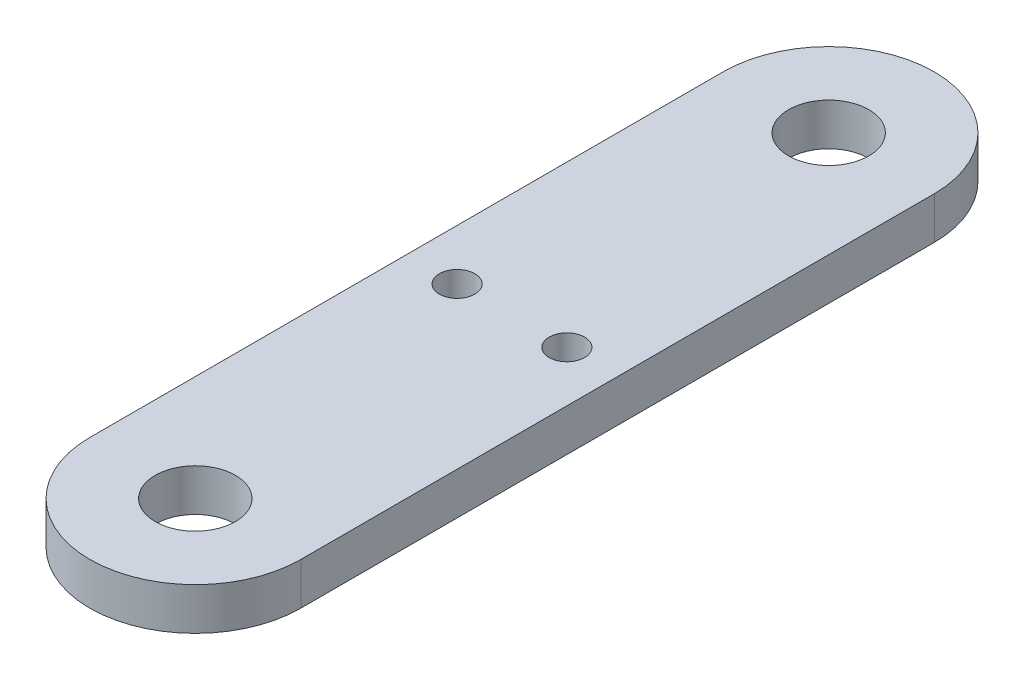
ISO-10303-21;
HEADER;
FILE_DESCRIPTION(('STEP AP214'),'2;1');
FILE_NAME('part.step','',(''),(''),'','','');
FILE_SCHEMA(('AUTOMOTIVE_DESIGN { 1 0 10303 214 1 1 1 1 }'));
ENDSEC;
DATA;
#1=APPLICATION_CONTEXT('core data for automotive mechanical design processes');
#2=APPLICATION_PROTOCOL_DEFINITION('international standard','automotive_design',2000,#1);
#3=PRODUCT_CONTEXT('',#1,'mechanical');
#4=PRODUCT('Part','Part','',(#3));
#5=PRODUCT_RELATED_PRODUCT_CATEGORY('part','',(#4));
#6=PRODUCT_DEFINITION_FORMATION('','',#4);
#7=PRODUCT_DEFINITION_CONTEXT('part definition',#1,'design');
#8=PRODUCT_DEFINITION('design','',#6,#7);
#9=PRODUCT_DEFINITION_SHAPE('','',#8);
#10=(LENGTH_UNIT() NAMED_UNIT(*) SI_UNIT(.MILLI.,.METRE.));
#11=(NAMED_UNIT(*) PLANE_ANGLE_UNIT() SI_UNIT($,.RADIAN.));
#12=(NAMED_UNIT(*) SI_UNIT($,.STERADIAN.) SOLID_ANGLE_UNIT());
#13=UNCERTAINTY_MEASURE_WITH_UNIT(LENGTH_MEASURE(1.E-05),#10,'distance_accuracy_value','');
#14=(GEOMETRIC_REPRESENTATION_CONTEXT(3) GLOBAL_UNCERTAINTY_ASSIGNED_CONTEXT((#13)) GLOBAL_UNIT_ASSIGNED_CONTEXT((#10,
#11,#12)) REPRESENTATION_CONTEXT('',''));
#15=CARTESIAN_POINT('',(0.,0.,0.));
#16=DIRECTION('',(0.,0.,1.));
#17=DIRECTION('',(1.,0.,0.));
#18=AXIS2_PLACEMENT_3D('',#15,#16,#17);
#19=CARTESIAN_POINT('',(0.,5.,-37.5));
#20=DIRECTION('',(0.,-1.,0.));
#21=DIRECTION('',(0.,0.,-1.));
#22=AXIS2_PLACEMENT_3D('',#19,#20,#21);
#23=CYLINDRICAL_SURFACE('',#22,12.5);
#24=CARTESIAN_POINT('',(0.,0.,-37.5));
#25=DIRECTION('',(0.,1.,0.));
#26=DIRECTION('',(0.,0.,1.));
#27=AXIS2_PLACEMENT_3D('',#24,#25,#26);
#28=CIRCLE('',#27,12.5);
#29=CARTESIAN_POINT('',(12.5,0.,-37.5));
#30=VERTEX_POINT('',#29);
#31=CARTESIAN_POINT('',(-12.5,0.,-37.5));
#32=VERTEX_POINT('',#31);
#33=EDGE_CURVE('E120',#30,#32,#28,.T.);
#34=ORIENTED_EDGE('',*,*,#33,.T.);
#35=DIRECTION('',(0.,-1.,0.));
#36=VECTOR('',#35,1.);
#37=CARTESIAN_POINT('',(-12.5,5.,-37.5));
#38=LINE('',#37,#36);
#39=CARTESIAN_POINT('',(-12.5,5.,-37.5));
#40=VERTEX_POINT('',#39);
#41=EDGE_CURVE('E11',#40,#32,#38,.T.);
#42=ORIENTED_EDGE('',*,*,#41,.F.);
#43=CARTESIAN_POINT('',(0.,5.,-37.5));
#44=DIRECTION('',(0.,1.,0.));
#45=DIRECTION('',(0.,0.,1.));
#46=AXIS2_PLACEMENT_3D('',#43,#44,#45);
#47=CIRCLE('',#46,12.5);
#48=CARTESIAN_POINT('',(12.5,5.,-37.5));
#49=VERTEX_POINT('',#48);
#50=EDGE_CURVE('E84',#49,#40,#47,.T.);
#51=ORIENTED_EDGE('',*,*,#50,.F.);
#52=DIRECTION('',(0.,-1.,0.));
#53=VECTOR('',#52,1.);
#54=CARTESIAN_POINT('',(12.5,5.,-37.5));
#55=LINE('',#54,#53);
#56=EDGE_CURVE('E116',#49,#30,#55,.T.);
#57=ORIENTED_EDGE('',*,*,#56,.T.);
#58=EDGE_LOOP('',(#34,#42,#51,#57));
#59=FACE_BOUND('',#58,.T.);
#60=ADVANCED_FACE('F41',(#59),#23,.T.);
#61=CARTESIAN_POINT('',(-12.5,5.,0.));
#62=DIRECTION('',(-1.,0.,0.));
#63=DIRECTION('',(0.,0.,1.));
#64=AXIS2_PLACEMENT_3D('',#61,#62,#63);
#65=PLANE('',#64);
#66=DIRECTION('',(0.,0.,-1.));
#67=VECTOR('',#66,1.);
#68=CARTESIAN_POINT('',(-12.5,0.,0.));
#69=LINE('',#68,#67);
#70=CARTESIAN_POINT('',(-12.5,0.,37.5));
#71=VERTEX_POINT('',#70);
#72=EDGE_CURVE('E94',#71,#32,#69,.T.);
#73=ORIENTED_EDGE('',*,*,#72,.F.);
#74=DIRECTION('',(0.,-1.,0.));
#75=VECTOR('',#74,1.);
#76=CARTESIAN_POINT('',(-12.5,5.,37.5));
#77=LINE('',#76,#75);
#78=CARTESIAN_POINT('',(-12.5,5.,37.5));
#79=VERTEX_POINT('',#78);
#80=EDGE_CURVE('E50',#79,#71,#77,.T.);
#81=ORIENTED_EDGE('',*,*,#80,.F.);
#82=DIRECTION('',(0.,0.,-1.));
#83=VECTOR('',#82,1.);
#84=CARTESIAN_POINT('',(-12.5,5.,0.));
#85=LINE('',#84,#83);
#86=EDGE_CURVE('E92',#79,#40,#85,.T.);
#87=ORIENTED_EDGE('',*,*,#86,.T.);
#88=ORIENTED_EDGE('',*,*,#41,.T.);
#89=EDGE_LOOP('',(#73,#81,#87,#88));
#90=FACE_BOUND('',#89,.T.);
#91=ADVANCED_FACE('F91',(#90),#65,.T.);
#92=CARTESIAN_POINT('',(0.,5.,37.5));
#93=DIRECTION('',(0.,-1.,0.));
#94=DIRECTION('',(0.,0.,-1.));
#95=AXIS2_PLACEMENT_3D('',#92,#93,#94);
#96=CYLINDRICAL_SURFACE('',#95,12.5);
#97=CARTESIAN_POINT('',(0.,0.,37.5));
#98=DIRECTION('',(0.,1.,0.));
#99=DIRECTION('',(0.,0.,1.));
#100=AXIS2_PLACEMENT_3D('',#97,#98,#99);
#101=CIRCLE('',#100,12.5);
#102=CARTESIAN_POINT('',(12.5,0.,37.5));
#103=VERTEX_POINT('',#102);
#104=EDGE_CURVE('E73',#71,#103,#101,.T.);
#105=ORIENTED_EDGE('',*,*,#104,.T.);
#106=DIRECTION('',(0.,-1.,0.));
#107=VECTOR('',#106,1.);
#108=CARTESIAN_POINT('',(12.5,5.,37.5));
#109=LINE('',#108,#107);
#110=CARTESIAN_POINT('',(12.5,5.,37.5));
#111=VERTEX_POINT('',#110);
#112=EDGE_CURVE('E95',#111,#103,#109,.T.);
#113=ORIENTED_EDGE('',*,*,#112,.F.);
#114=CARTESIAN_POINT('',(0.,5.,37.5));
#115=DIRECTION('',(0.,1.,0.));
#116=DIRECTION('',(0.,0.,1.));
#117=AXIS2_PLACEMENT_3D('',#114,#115,#116);
#118=CIRCLE('',#117,12.5);
#119=EDGE_CURVE('E96',#79,#111,#118,.T.);
#120=ORIENTED_EDGE('',*,*,#119,.F.);
#121=ORIENTED_EDGE('',*,*,#80,.T.);
#122=EDGE_LOOP('',(#105,#113,#120,#121));
#123=FACE_BOUND('',#122,.T.);
#124=ADVANCED_FACE('F97',(#123),#96,.T.);
#125=CARTESIAN_POINT('',(-6.5,5.,0.));
#126=DIRECTION('',(0.,-1.,0.));
#127=DIRECTION('',(0.,0.,-1.));
#128=AXIS2_PLACEMENT_3D('',#125,#126,#127);
#129=CYLINDRICAL_SURFACE('',#128,2.1);
#130=CARTESIAN_POINT('',(-6.5,5.,0.));
#131=DIRECTION('',(0.,1.,0.));
#132=DIRECTION('',(0.,0.,1.));
#133=AXIS2_PLACEMENT_3D('',#130,#131,#132);
#134=CIRCLE('',#133,2.1);
#135=CARTESIAN_POINT('',(-6.5,5.,2.1));
#136=VERTEX_POINT('',#135);
#137=EDGE_CURVE('E110',#136,#136,#134,.T.);
#138=ORIENTED_EDGE('',*,*,#137,.T.);
#139=EDGE_LOOP('',(#138));
#140=FACE_BOUND('',#139,.T.);
#141=CARTESIAN_POINT('',(-6.5,0.,0.));
#142=DIRECTION('',(0.,1.,0.));
#143=DIRECTION('',(0.,0.,1.));
#144=AXIS2_PLACEMENT_3D('',#141,#142,#143);
#145=CIRCLE('',#144,2.1);
#146=CARTESIAN_POINT('',(-6.5,0.,2.1));
#147=VERTEX_POINT('',#146);
#148=EDGE_CURVE('E129',#147,#147,#145,.T.);
#149=ORIENTED_EDGE('',*,*,#148,.F.);
#150=EDGE_LOOP('',(#149));
#151=FACE_BOUND('',#150,.T.);
#152=ADVANCED_FACE('F150',(#140,#151),#129,.F.);
#153=CARTESIAN_POINT('',(6.5,5.,0.));
#154=DIRECTION('',(0.,-1.,0.));
#155=DIRECTION('',(0.,0.,-1.));
#156=AXIS2_PLACEMENT_3D('',#153,#154,#155);
#157=CYLINDRICAL_SURFACE('',#156,2.1);
#158=CARTESIAN_POINT('',(6.5,5.,0.));
#159=DIRECTION('',(0.,1.,0.));
#160=DIRECTION('',(0.,0.,1.));
#161=AXIS2_PLACEMENT_3D('',#158,#159,#160);
#162=CIRCLE('',#161,2.1);
#163=CARTESIAN_POINT('',(6.5,5.,2.1));
#164=VERTEX_POINT('',#163);
#165=EDGE_CURVE('E107',#164,#164,#162,.T.);
#166=ORIENTED_EDGE('',*,*,#165,.T.);
#167=EDGE_LOOP('',(#166));
#168=FACE_BOUND('',#167,.T.);
#169=CARTESIAN_POINT('',(6.5,0.,0.));
#170=DIRECTION('',(0.,1.,0.));
#171=DIRECTION('',(0.,0.,1.));
#172=AXIS2_PLACEMENT_3D('',#169,#170,#171);
#173=CIRCLE('',#172,2.1);
#174=CARTESIAN_POINT('',(6.5,0.,2.1));
#175=VERTEX_POINT('',#174);
#176=EDGE_CURVE('E126',#175,#175,#173,.T.);
#177=ORIENTED_EDGE('',*,*,#176,.F.);
#178=EDGE_LOOP('',(#177));
#179=FACE_BOUND('',#178,.T.);
#180=ADVANCED_FACE('F153',(#168,#179),#157,.F.);
#181=CARTESIAN_POINT('',(12.5,5.,0.));
#182=DIRECTION('',(-1.,0.,0.));
#183=DIRECTION('',(0.,0.,1.));
#184=AXIS2_PLACEMENT_3D('',#181,#182,#183);
#185=PLANE('',#184);
#186=DIRECTION('',(0.,0.,-1.));
#187=VECTOR('',#186,1.);
#188=CARTESIAN_POINT('',(12.5,0.,0.));
#189=LINE('',#188,#187);
#190=EDGE_CURVE('E79',#103,#30,#189,.T.);
#191=ORIENTED_EDGE('',*,*,#190,.T.);
#192=ORIENTED_EDGE('',*,*,#56,.F.);
#193=DIRECTION('',(0.,0.,-1.));
#194=VECTOR('',#193,1.);
#195=CARTESIAN_POINT('',(12.5,5.,0.));
#196=LINE('',#195,#194);
#197=EDGE_CURVE('E58',#111,#49,#196,.T.);
#198=ORIENTED_EDGE('',*,*,#197,.F.);
#199=ORIENTED_EDGE('',*,*,#112,.T.);
#200=EDGE_LOOP('',(#191,#192,#198,#199));
#201=FACE_BOUND('',#200,.T.);
#202=ADVANCED_FACE('F136',(#201),#185,.F.);
#203=CARTESIAN_POINT('',(0.,5.,-37.5));
#204=DIRECTION('',(0.,-1.,0.));
#205=DIRECTION('',(0.,0.,-1.));
#206=AXIS2_PLACEMENT_3D('',#203,#204,#205);
#207=CYLINDRICAL_SURFACE('',#206,4.75);
#208=CARTESIAN_POINT('',(0.,5.,-37.5));
#209=DIRECTION('',(0.,1.,0.));
#210=DIRECTION('',(0.,0.,1.));
#211=AXIS2_PLACEMENT_3D('',#208,#209,#210);
#212=CIRCLE('',#211,4.75);
#213=CARTESIAN_POINT('',(0.,5.,-32.75));
#214=VERTEX_POINT('',#213);
#215=EDGE_CURVE('E102',#214,#214,#212,.T.);
#216=ORIENTED_EDGE('',*,*,#215,.T.);
#217=EDGE_LOOP('',(#216));
#218=FACE_BOUND('',#217,.T.);
#219=CARTESIAN_POINT('',(0.,0.,-37.5));
#220=DIRECTION('',(0.,1.,0.));
#221=DIRECTION('',(0.,0.,1.));
#222=AXIS2_PLACEMENT_3D('',#219,#220,#221);
#223=CIRCLE('',#222,4.75);
#224=CARTESIAN_POINT('',(0.,0.,-32.75));
#225=VERTEX_POINT('',#224);
#226=EDGE_CURVE('E117',#225,#225,#223,.T.);
#227=ORIENTED_EDGE('',*,*,#226,.F.);
#228=EDGE_LOOP('',(#227));
#229=FACE_BOUND('',#228,.T.);
#230=ADVANCED_FACE('F43',(#218,#229),#207,.F.);
#231=CARTESIAN_POINT('',(0.,5.,37.5));
#232=DIRECTION('',(0.,-1.,0.));
#233=DIRECTION('',(0.,0.,-1.));
#234=AXIS2_PLACEMENT_3D('',#231,#232,#233);
#235=CYLINDRICAL_SURFACE('',#234,4.75);
#236=CARTESIAN_POINT('',(0.,5.,37.5));
#237=DIRECTION('',(0.,1.,0.));
#238=DIRECTION('',(0.,0.,1.));
#239=AXIS2_PLACEMENT_3D('',#236,#237,#238);
#240=CIRCLE('',#239,4.75);
#241=CARTESIAN_POINT('',(0.,5.,42.25));
#242=VERTEX_POINT('',#241);
#243=EDGE_CURVE('E113',#242,#242,#240,.T.);
#244=ORIENTED_EDGE('',*,*,#243,.T.);
#245=EDGE_LOOP('',(#244));
#246=FACE_BOUND('',#245,.T.);
#247=CARTESIAN_POINT('',(0.,0.,37.5));
#248=DIRECTION('',(0.,1.,0.));
#249=DIRECTION('',(0.,0.,1.));
#250=AXIS2_PLACEMENT_3D('',#247,#248,#249);
#251=CIRCLE('',#250,4.75);
#252=CARTESIAN_POINT('',(0.,0.,42.25));
#253=VERTEX_POINT('',#252);
#254=EDGE_CURVE('E132',#253,#253,#251,.T.);
#255=ORIENTED_EDGE('',*,*,#254,.F.);
#256=EDGE_LOOP('',(#255));
#257=FACE_BOUND('',#256,.T.);
#258=ADVANCED_FACE('F160',(#246,#257),#235,.F.);
#259=CARTESIAN_POINT('',(0.,5.,0.));
#260=DIRECTION('',(0.,1.,0.));
#261=DIRECTION('',(0.,0.,1.));
#262=AXIS2_PLACEMENT_3D('',#259,#260,#261);
#263=PLANE('',#262);
#264=ORIENTED_EDGE('',*,*,#215,.F.);
#265=EDGE_LOOP('',(#264));
#266=FACE_BOUND('',#265,.T.);
#267=ORIENTED_EDGE('',*,*,#50,.T.);
#268=ORIENTED_EDGE('',*,*,#86,.F.);
#269=ORIENTED_EDGE('',*,*,#119,.T.);
#270=ORIENTED_EDGE('',*,*,#197,.T.);
#271=EDGE_LOOP('',(#267,#268,#269,#270));
#272=FACE_BOUND('',#271,.T.);
#273=ORIENTED_EDGE('',*,*,#165,.F.);
#274=EDGE_LOOP('',(#273));
#275=FACE_BOUND('',#274,.T.);
#276=ORIENTED_EDGE('',*,*,#137,.F.);
#277=EDGE_LOOP('',(#276));
#278=FACE_BOUND('',#277,.T.);
#279=ORIENTED_EDGE('',*,*,#243,.F.);
#280=EDGE_LOOP('',(#279));
#281=FACE_BOUND('',#280,.T.);
#282=ADVANCED_FACE('F99',(#266,#272,#275,#278,#281),#263,.T.);
#283=CARTESIAN_POINT('',(0.,0.,0.));
#284=DIRECTION('',(0.,1.,0.));
#285=DIRECTION('',(0.,0.,1.));
#286=AXIS2_PLACEMENT_3D('',#283,#284,#285);
#287=PLANE('',#286);
#288=ORIENTED_EDGE('',*,*,#226,.T.);
#289=EDGE_LOOP('',(#288));
#290=FACE_BOUND('',#289,.T.);
#291=ORIENTED_EDGE('',*,*,#33,.F.);
#292=ORIENTED_EDGE('',*,*,#190,.F.);
#293=ORIENTED_EDGE('',*,*,#104,.F.);
#294=ORIENTED_EDGE('',*,*,#72,.T.);
#295=EDGE_LOOP('',(#291,#292,#293,#294));
#296=FACE_BOUND('',#295,.T.);
#297=ORIENTED_EDGE('',*,*,#176,.T.);
#298=EDGE_LOOP('',(#297));
#299=FACE_BOUND('',#298,.T.);
#300=ORIENTED_EDGE('',*,*,#148,.T.);
#301=EDGE_LOOP('',(#300));
#302=FACE_BOUND('',#301,.T.);
#303=ORIENTED_EDGE('',*,*,#254,.T.);
#304=EDGE_LOOP('',(#303));
#305=FACE_BOUND('',#304,.T.);
#306=ADVANCED_FACE('F139',(#290,#296,#299,#302,#305),#287,.F.);
#307=CLOSED_SHELL('',(#60,#91,#124,#152,#180,#202,#230,#258,#282,#306));
#308=MANIFOLD_SOLID_BREP('B2',#307);
#309=ADVANCED_BREP_SHAPE_REPRESENTATION('',(#18,#308),#14);
#310=SHAPE_DEFINITION_REPRESENTATION(#9,#309);
ENDSEC;
END-ISO-10303-21;
